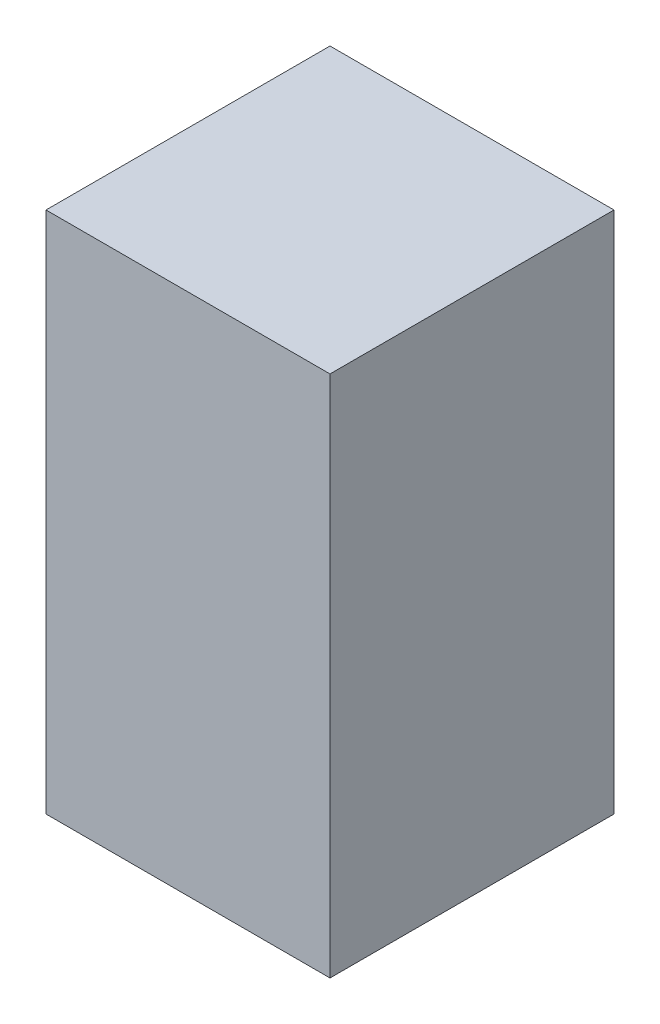
ISO-10303-21;
HEADER;
FILE_DESCRIPTION(('STEP AP214'),'2;1');
FILE_NAME('part.step','',(''),(''),'','','');
FILE_SCHEMA(('AUTOMOTIVE_DESIGN { 1 0 10303 214 1 1 1 1 }'));
ENDSEC;
DATA;
#1=APPLICATION_CONTEXT('core data for automotive mechanical design processes');
#2=APPLICATION_PROTOCOL_DEFINITION('international standard','automotive_design',2000,#1);
#3=PRODUCT_CONTEXT('',#1,'mechanical');
#4=PRODUCT('Part','Part','',(#3));
#5=PRODUCT_RELATED_PRODUCT_CATEGORY('part','',(#4));
#6=PRODUCT_DEFINITION_FORMATION('','',#4);
#7=PRODUCT_DEFINITION_CONTEXT('part definition',#1,'design');
#8=PRODUCT_DEFINITION('design','',#6,#7);
#9=PRODUCT_DEFINITION_SHAPE('','',#8);
#10=(LENGTH_UNIT() NAMED_UNIT(*) SI_UNIT(.MILLI.,.METRE.));
#11=(NAMED_UNIT(*) PLANE_ANGLE_UNIT() SI_UNIT($,.RADIAN.));
#12=(NAMED_UNIT(*) SI_UNIT($,.STERADIAN.) SOLID_ANGLE_UNIT());
#13=UNCERTAINTY_MEASURE_WITH_UNIT(LENGTH_MEASURE(1.E-05),#10,'distance_accuracy_value','');
#14=(GEOMETRIC_REPRESENTATION_CONTEXT(3) GLOBAL_UNCERTAINTY_ASSIGNED_CONTEXT((#13)) GLOBAL_UNIT_ASSIGNED_CONTEXT((#10,
#11,#12)) REPRESENTATION_CONTEXT('',''));
#15=CARTESIAN_POINT('',(0.,0.,0.));
#16=DIRECTION('',(0.,0.,1.));
#17=DIRECTION('',(1.,0.,0.));
#18=AXIS2_PLACEMENT_3D('',#15,#16,#17);
#19=CARTESIAN_POINT('',(-0.47500032,-0.87499952,0.95));
#20=DIRECTION('',(0.,0.,-1.));
#21=DIRECTION('',(-1.,0.,0.));
#22=AXIS2_PLACEMENT_3D('',#19,#20,#21);
#23=PLANE('',#22);
#24=DIRECTION('',(0.,1.,0.));
#25=VECTOR('',#24,1.);
#26=CARTESIAN_POINT('',(0.47500032,-0.87499952,0.95));
#27=LINE('',#26,#25);
#28=CARTESIAN_POINT('',(0.47500032,-0.87499952,0.95));
#29=VERTEX_POINT('',#28);
#30=CARTESIAN_POINT('',(0.47500032,0.87500206,0.95));
#31=VERTEX_POINT('',#30);
#32=EDGE_CURVE('E54',#29,#31,#27,.T.);
#33=ORIENTED_EDGE('',*,*,#32,.T.);
#34=DIRECTION('',(1.,0.,0.));
#35=VECTOR('',#34,1.);
#36=CARTESIAN_POINT('',(0.47500032,0.87500206,0.95));
#37=LINE('',#36,#35);
#38=CARTESIAN_POINT('',(-0.47500032,0.87500206,0.95));
#39=VERTEX_POINT('',#38);
#40=EDGE_CURVE('E57',#31,#39,#37,.F.);
#41=ORIENTED_EDGE('',*,*,#40,.T.);
#42=DIRECTION('',(0.,1.,0.));
#43=VECTOR('',#42,1.);
#44=CARTESIAN_POINT('',(-0.47500032,0.87500206,0.95));
#45=LINE('',#44,#43);
#46=CARTESIAN_POINT('',(-0.47500032,-0.87499952,0.95));
#47=VERTEX_POINT('',#46);
#48=EDGE_CURVE('E59',#39,#47,#45,.F.);
#49=ORIENTED_EDGE('',*,*,#48,.T.);
#50=DIRECTION('',(-1.,0.,0.));
#51=VECTOR('',#50,1.);
#52=CARTESIAN_POINT('',(-0.47500032,-0.87499952,0.95));
#53=LINE('',#52,#51);
#54=EDGE_CURVE('E19',#29,#47,#53,.T.);
#55=ORIENTED_EDGE('',*,*,#54,.F.);
#56=EDGE_LOOP('',(#33,#41,#49,#55));
#57=FACE_BOUND('',#56,.T.);
#58=ADVANCED_FACE('F16',(#57),#23,.F.);
#59=CARTESIAN_POINT('',(-0.47500032,0.87500206,0.));
#60=DIRECTION('',(1.,0.,0.));
#61=DIRECTION('',(0.,0.,-1.));
#62=AXIS2_PLACEMENT_3D('',#59,#60,#61);
#63=PLANE('',#62);
#64=DIRECTION('',(0.,0.,1.));
#65=VECTOR('',#64,1.);
#66=CARTESIAN_POINT('',(-0.47500032,-0.87499952,0.));
#67=LINE('',#66,#65);
#68=CARTESIAN_POINT('',(-0.47500032,-0.87499952,0.));
#69=VERTEX_POINT('',#68);
#70=EDGE_CURVE('E70',#69,#47,#67,.T.);
#71=ORIENTED_EDGE('',*,*,#70,.T.);
#72=ORIENTED_EDGE('',*,*,#48,.F.);
#73=DIRECTION('',(0.,0.,-1.));
#74=VECTOR('',#73,1.);
#75=CARTESIAN_POINT('',(-0.47500032,0.87500206,0.));
#76=LINE('',#75,#74);
#77=CARTESIAN_POINT('',(-0.47500032,0.87500206,0.));
#78=VERTEX_POINT('',#77);
#79=EDGE_CURVE('E64',#39,#78,#76,.T.);
#80=ORIENTED_EDGE('',*,*,#79,.T.);
#81=DIRECTION('',(0.,1.,0.));
#82=VECTOR('',#81,1.);
#83=CARTESIAN_POINT('',(-0.47500032,-0.87499952,0.));
#84=LINE('',#83,#82);
#85=EDGE_CURVE('E82',#69,#78,#84,.T.);
#86=ORIENTED_EDGE('',*,*,#85,.F.);
#87=EDGE_LOOP('',(#71,#72,#80,#86));
#88=FACE_BOUND('',#87,.T.);
#89=ADVANCED_FACE('F67',(#88),#63,.F.);
#90=CARTESIAN_POINT('',(0.47500032,0.87500206,0.));
#91=DIRECTION('',(0.,-1.,0.));
#92=DIRECTION('',(0.,0.,-1.));
#93=AXIS2_PLACEMENT_3D('',#90,#91,#92);
#94=PLANE('',#93);
#95=ORIENTED_EDGE('',*,*,#79,.F.);
#96=ORIENTED_EDGE('',*,*,#40,.F.);
#97=DIRECTION('',(0.,0.,1.));
#98=VECTOR('',#97,1.);
#99=CARTESIAN_POINT('',(0.47500032,0.87500206,0.));
#100=LINE('',#99,#98);
#101=CARTESIAN_POINT('',(0.47500032,0.87500206,0.));
#102=VERTEX_POINT('',#101);
#103=EDGE_CURVE('E76',#31,#102,#100,.F.);
#104=ORIENTED_EDGE('',*,*,#103,.T.);
#105=DIRECTION('',(-1.,0.,0.));
#106=VECTOR('',#105,1.);
#107=CARTESIAN_POINT('',(-0.47500032,0.87500206,0.));
#108=LINE('',#107,#106);
#109=EDGE_CURVE('E73',#78,#102,#108,.F.);
#110=ORIENTED_EDGE('',*,*,#109,.F.);
#111=EDGE_LOOP('',(#95,#96,#104,#110));
#112=FACE_BOUND('',#111,.T.);
#113=ADVANCED_FACE('F71',(#112),#94,.F.);
#114=CARTESIAN_POINT('',(0.47500032,-0.87499952,0.));
#115=DIRECTION('',(-1.,0.,0.));
#116=DIRECTION('',(0.,0.,1.));
#117=AXIS2_PLACEMENT_3D('',#114,#115,#116);
#118=PLANE('',#117);
#119=ORIENTED_EDGE('',*,*,#103,.F.);
#120=ORIENTED_EDGE('',*,*,#32,.F.);
#121=DIRECTION('',(0.,0.,1.));
#122=VECTOR('',#121,1.);
#123=CARTESIAN_POINT('',(0.47500032,-0.87499952,0.));
#124=LINE('',#123,#122);
#125=CARTESIAN_POINT('',(0.47500032,-0.87499952,0.));
#126=VERTEX_POINT('',#125);
#127=EDGE_CURVE('E34',#29,#126,#124,.F.);
#128=ORIENTED_EDGE('',*,*,#127,.T.);
#129=DIRECTION('',(0.,1.,0.));
#130=VECTOR('',#129,1.);
#131=CARTESIAN_POINT('',(0.47500032,-0.87499952,0.));
#132=LINE('',#131,#130);
#133=EDGE_CURVE('E25',#102,#126,#132,.F.);
#134=ORIENTED_EDGE('',*,*,#133,.F.);
#135=EDGE_LOOP('',(#119,#120,#128,#134));
#136=FACE_BOUND('',#135,.T.);
#137=ADVANCED_FACE('F88',(#136),#118,.F.);
#138=CARTESIAN_POINT('',(-0.47500032,-0.87499952,0.));
#139=DIRECTION('',(0.,1.,0.));
#140=DIRECTION('',(0.,0.,1.));
#141=AXIS2_PLACEMENT_3D('',#138,#139,#140);
#142=PLANE('',#141);
#143=ORIENTED_EDGE('',*,*,#127,.F.);
#144=ORIENTED_EDGE('',*,*,#54,.T.);
#145=ORIENTED_EDGE('',*,*,#70,.F.);
#146=DIRECTION('',(-1.,0.,0.));
#147=VECTOR('',#146,1.);
#148=CARTESIAN_POINT('',(-0.47500032,-0.87499952,0.));
#149=LINE('',#148,#147);
#150=EDGE_CURVE('E11',#126,#69,#149,.T.);
#151=ORIENTED_EDGE('',*,*,#150,.F.);
#152=EDGE_LOOP('',(#143,#144,#145,#151));
#153=FACE_BOUND('',#152,.T.);
#154=ADVANCED_FACE('F90',(#153),#142,.F.);
#155=CARTESIAN_POINT('',(-0.47500032,-0.87499952,0.));
#156=DIRECTION('',(0.,0.,-1.));
#157=DIRECTION('',(-1.,0.,0.));
#158=AXIS2_PLACEMENT_3D('',#155,#156,#157);
#159=PLANE('',#158);
#160=ORIENTED_EDGE('',*,*,#133,.T.);
#161=ORIENTED_EDGE('',*,*,#150,.T.);
#162=ORIENTED_EDGE('',*,*,#85,.T.);
#163=ORIENTED_EDGE('',*,*,#109,.T.);
#164=EDGE_LOOP('',(#160,#161,#162,#163));
#165=FACE_BOUND('',#164,.T.);
#166=ADVANCED_FACE('F87',(#165),#159,.T.);
#167=CLOSED_SHELL('',(#58,#89,#113,#137,#154,#166));
#168=MANIFOLD_SOLID_BREP('B1',#167);
#169=ADVANCED_BREP_SHAPE_REPRESENTATION('',(#18,#168),#14);
#170=SHAPE_DEFINITION_REPRESENTATION(#9,#169);
ENDSEC;
END-ISO-10303-21;
